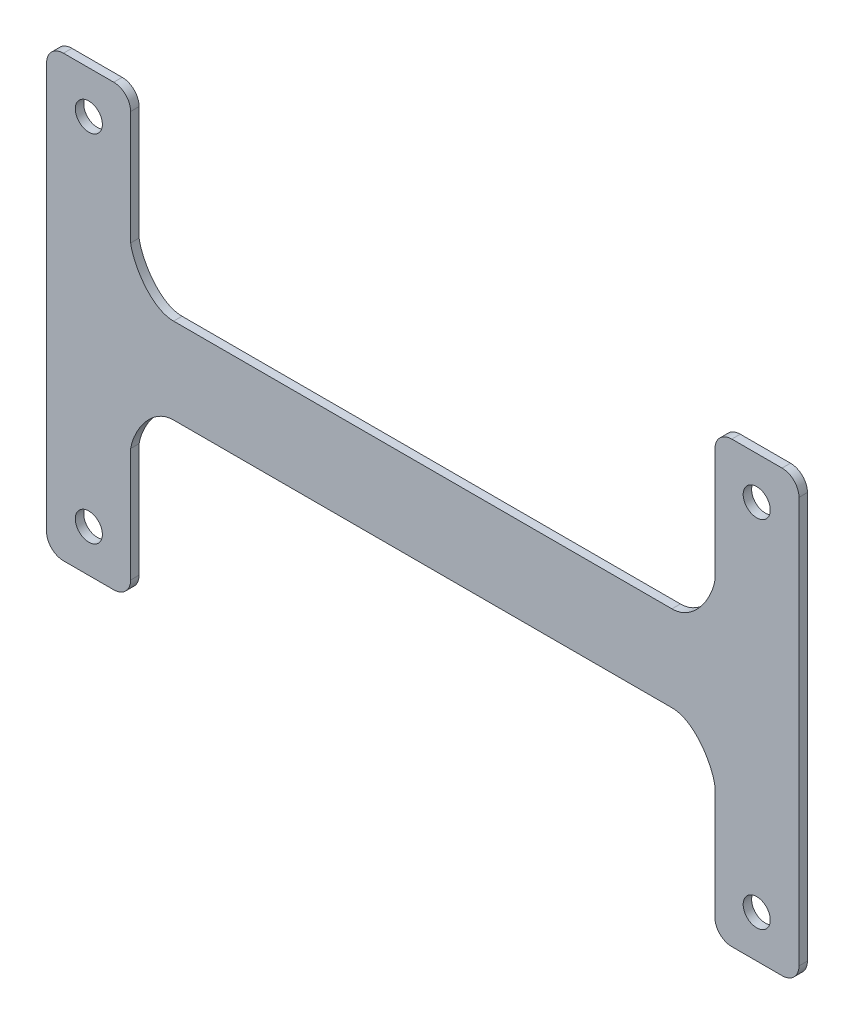
ISO-10303-21;
HEADER;
FILE_DESCRIPTION(('STEP AP214'),'2;1');
FILE_NAME('part.step','',(''),(''),'','','');
FILE_SCHEMA(('AUTOMOTIVE_DESIGN { 1 0 10303 214 1 1 1 1 }'));
ENDSEC;
DATA;
#1=APPLICATION_CONTEXT('core data for automotive mechanical design processes');
#2=APPLICATION_PROTOCOL_DEFINITION('international standard','automotive_design',2000,#1);
#3=PRODUCT_CONTEXT('',#1,'mechanical');
#4=PRODUCT('Part','Part','',(#3));
#5=PRODUCT_RELATED_PRODUCT_CATEGORY('part','',(#4));
#6=PRODUCT_DEFINITION_FORMATION('','',#4);
#7=PRODUCT_DEFINITION_CONTEXT('part definition',#1,'design');
#8=PRODUCT_DEFINITION('design','',#6,#7);
#9=PRODUCT_DEFINITION_SHAPE('','',#8);
#10=(LENGTH_UNIT() NAMED_UNIT(*) SI_UNIT(.MILLI.,.METRE.));
#11=(NAMED_UNIT(*) PLANE_ANGLE_UNIT() SI_UNIT($,.RADIAN.));
#12=(NAMED_UNIT(*) SI_UNIT($,.STERADIAN.) SOLID_ANGLE_UNIT());
#13=UNCERTAINTY_MEASURE_WITH_UNIT(LENGTH_MEASURE(1.E-05),#10,'distance_accuracy_value','');
#14=(GEOMETRIC_REPRESENTATION_CONTEXT(3) GLOBAL_UNCERTAINTY_ASSIGNED_CONTEXT((#13)) GLOBAL_UNIT_ASSIGNED_CONTEXT((#10,
#11,#12)) REPRESENTATION_CONTEXT('',''));
#15=CARTESIAN_POINT('',(0.,0.,0.));
#16=DIRECTION('',(0.,0.,1.));
#17=DIRECTION('',(1.,0.,0.));
#18=AXIS2_PLACEMENT_3D('',#15,#16,#17);
#19=CARTESIAN_POINT('',(44.5,-26.,-1.));
#20=DIRECTION('',(0.,-1.,0.));
#21=DIRECTION('',(1.,0.,0.));
#22=AXIS2_PLACEMENT_3D('',#19,#20,#21);
#23=PLANE('',#22);
#24=DIRECTION('',(1.,0.,0.));
#25=VECTOR('',#24,1.);
#26=CARTESIAN_POINT('',(44.5,-26.,-1.));
#27=LINE('',#26,#25);
#28=CARTESIAN_POINT('',(36.5550898515335,-26.,-1.));
#29=VERTEX_POINT('',#28);
#30=CARTESIAN_POINT('',(42.5,-26.,-1.));
#31=VERTEX_POINT('',#30);
#32=EDGE_CURVE('E368',#29,#31,#27,.T.);
#33=ORIENTED_EDGE('',*,*,#32,.T.);
#34=DIRECTION('',(0.,0.,1.));
#35=VECTOR('',#34,1.);
#36=CARTESIAN_POINT('',(42.5,-26.,-1.));
#37=LINE('',#36,#35);
#38=CARTESIAN_POINT('',(42.5,-26.,0.));
#39=VERTEX_POINT('',#38);
#40=EDGE_CURVE('E302',#31,#39,#37,.T.);
#41=ORIENTED_EDGE('',*,*,#40,.T.);
#42=DIRECTION('',(1.,0.,0.));
#43=VECTOR('',#42,1.);
#44=CARTESIAN_POINT('',(44.5,-26.,0.));
#45=LINE('',#44,#43);
#46=CARTESIAN_POINT('',(36.5550898515335,-26.,0.));
#47=VERTEX_POINT('',#46);
#48=EDGE_CURVE('E424',#47,#39,#45,.T.);
#49=ORIENTED_EDGE('',*,*,#48,.F.);
#50=DIRECTION('',(0.,0.,1.));
#51=VECTOR('',#50,1.);
#52=CARTESIAN_POINT('',(36.5550898515335,-26.,-1.));
#53=LINE('',#52,#51);
#54=EDGE_CURVE('E307',#47,#29,#53,.F.);
#55=ORIENTED_EDGE('',*,*,#54,.T.);
#56=EDGE_LOOP('',(#33,#41,#49,#55));
#57=FACE_BOUND('',#56,.T.);
#58=ADVANCED_FACE('F33',(#57),#23,.T.);
#59=CARTESIAN_POINT('',(34.5550898515335,-10.5296083014168,-1.));
#60=DIRECTION('',(-1.,0.,0.));
#61=DIRECTION('',(0.,-1.,0.));
#62=AXIS2_PLACEMENT_3D('',#59,#60,#61);
#63=PLANE('',#62);
#64=DIRECTION('',(0.,-1.,0.));
#65=VECTOR('',#64,1.);
#66=CARTESIAN_POINT('',(34.5550898515335,-10.5296083014168,-1.));
#67=LINE('',#66,#65);
#68=CARTESIAN_POINT('',(34.5550898515335,-10.5296083014168,-1.));
#69=VERTEX_POINT('',#68);
#70=CARTESIAN_POINT('',(34.5550898515335,-24.,-1.));
#71=VERTEX_POINT('',#70);
#72=EDGE_CURVE('E213',#69,#71,#67,.T.);
#73=ORIENTED_EDGE('',*,*,#72,.T.);
#74=DIRECTION('',(0.,0.,1.));
#75=VECTOR('',#74,1.);
#76=CARTESIAN_POINT('',(34.5550898515335,-24.,-1.));
#77=LINE('',#76,#75);
#78=CARTESIAN_POINT('',(34.5550898515335,-24.,0.));
#79=VERTEX_POINT('',#78);
#80=EDGE_CURVE('E311',#71,#79,#77,.T.);
#81=ORIENTED_EDGE('',*,*,#80,.T.);
#82=DIRECTION('',(0.,-1.,0.));
#83=VECTOR('',#82,1.);
#84=CARTESIAN_POINT('',(34.5550898515335,-10.5296083014168,0.));
#85=LINE('',#84,#83);
#86=CARTESIAN_POINT('',(34.5550898515335,-10.5296083014168,0.));
#87=VERTEX_POINT('',#86);
#88=EDGE_CURVE('E365',#87,#79,#85,.T.);
#89=ORIENTED_EDGE('',*,*,#88,.F.);
#90=DIRECTION('',(0.,0.,1.));
#91=VECTOR('',#90,1.);
#92=CARTESIAN_POINT('',(34.5550898515335,-10.5296083014168,-1.));
#93=LINE('',#92,#91);
#94=EDGE_CURVE('E350',#69,#87,#93,.T.);
#95=ORIENTED_EDGE('',*,*,#94,.F.);
#96=EDGE_LOOP('',(#73,#81,#89,#95));
#97=FACE_BOUND('',#96,.T.);
#98=ADVANCED_FACE('F248',(#97),#63,.T.);
#99=CARTESIAN_POINT('',(29.4715570654732,-5.06722644424445,-1.));
#100=CARTESIAN_POINT('',(32.0820612443157,-5.04423915029166,-1.));
#101=CARTESIAN_POINT('',(34.2156660526155,-8.39349498213915,-1.));
#102=CARTESIAN_POINT('',(34.5550898515335,-10.5296083014168,-1.));
#103=B_SPLINE_CURVE_WITH_KNOTS('',3,(#99,#100,#101,#102),.UNSPECIFIED.,.F.,.F.,(4,4),(0.,1.),.UNSPECIFIED.);
#104=DIRECTION('',(0.,0.,1.));
#105=VECTOR('',#104,1.);
#106=SURFACE_OF_LINEAR_EXTRUSION('',#103,#105);
#107=CARTESIAN_POINT('',(29.4715570654732,-5.06722644424445,0.));
#108=CARTESIAN_POINT('',(32.0820612443157,-5.04423915029166,0.));
#109=CARTESIAN_POINT('',(34.2156660526155,-8.39349498213915,0.));
#110=CARTESIAN_POINT('',(34.5550898515335,-10.5296083014168,0.));
#111=B_SPLINE_CURVE_WITH_KNOTS('',3,(#107,#108,#109,#110),.UNSPECIFIED.,.F.,.F.,(4,4),(0.,1.),.UNSPECIFIED.);
#112=CARTESIAN_POINT('',(29.4715570654732,-5.06722644424445,0.));
#113=VERTEX_POINT('',#112);
#114=EDGE_CURVE('E369',#113,#87,#111,.T.);
#115=ORIENTED_EDGE('',*,*,#114,.F.);
#116=DIRECTION('',(0.,0.,1.));
#117=VECTOR('',#116,1.);
#118=CARTESIAN_POINT('',(29.4715570654732,-5.06722644424445,-1.));
#119=LINE('',#118,#117);
#120=CARTESIAN_POINT('',(29.4715570654732,-5.06722644424445,-1.));
#121=VERTEX_POINT('',#120);
#122=EDGE_CURVE('E362',#121,#113,#119,.T.);
#123=ORIENTED_EDGE('',*,*,#122,.F.);
#124=EDGE_CURVE('E430',#121,#69,#103,.T.);
#125=ORIENTED_EDGE('',*,*,#124,.T.);
#126=ORIENTED_EDGE('',*,*,#94,.T.);
#127=EDGE_LOOP('',(#115,#123,#125,#126));
#128=FACE_BOUND('',#127,.T.);
#129=ADVANCED_FACE('F442',(#128),#106,.T.);
#130=CARTESIAN_POINT('',(-29.4715570654732,-5.06722644424442,-1.));
#131=DIRECTION('',(0.,-1.,0.));
#132=DIRECTION('',(1.,0.,0.));
#133=AXIS2_PLACEMENT_3D('',#130,#131,#132);
#134=PLANE('',#133);
#135=DIRECTION('',(1.,0.,0.));
#136=VECTOR('',#135,1.);
#137=CARTESIAN_POINT('',(-29.4715570654732,-5.06722644424442,0.));
#138=LINE('',#137,#136);
#139=CARTESIAN_POINT('',(-29.4715570654732,-5.06722644424442,0.));
#140=VERTEX_POINT('',#139);
#141=EDGE_CURVE('E374',#140,#113,#138,.T.);
#142=ORIENTED_EDGE('',*,*,#141,.F.);
#143=DIRECTION('',(0.,0.,1.));
#144=VECTOR('',#143,1.);
#145=CARTESIAN_POINT('',(-29.4715570654732,-5.06722644424442,-1.));
#146=LINE('',#145,#144);
#147=CARTESIAN_POINT('',(-29.4715570654732,-5.06722644424442,-1.));
#148=VERTEX_POINT('',#147);
#149=EDGE_CURVE('E360',#148,#140,#146,.T.);
#150=ORIENTED_EDGE('',*,*,#149,.F.);
#151=DIRECTION('',(1.,0.,0.));
#152=VECTOR('',#151,1.);
#153=CARTESIAN_POINT('',(-29.4715570654732,-5.06722644424442,-1.));
#154=LINE('',#153,#152);
#155=EDGE_CURVE('E436',#148,#121,#154,.T.);
#156=ORIENTED_EDGE('',*,*,#155,.T.);
#157=ORIENTED_EDGE('',*,*,#122,.T.);
#158=EDGE_LOOP('',(#142,#150,#156,#157));
#159=FACE_BOUND('',#158,.T.);
#160=ADVANCED_FACE('F446',(#159),#134,.T.);
#161=CARTESIAN_POINT('',(-34.5550898515335,-10.5296083014167,-1.));
#162=CARTESIAN_POINT('',(-34.2156660526155,-8.3934949821391,-1.));
#163=CARTESIAN_POINT('',(-32.0820612443157,-5.04423915029165,-1.));
#164=CARTESIAN_POINT('',(-29.4715570654732,-5.06722644424442,-1.));
#165=B_SPLINE_CURVE_WITH_KNOTS('',3,(#161,#162,#163,#164),.UNSPECIFIED.,.F.,.F.,(4,4),(0.,1.),.UNSPECIFIED.);
#166=DIRECTION('',(0.,0.,1.));
#167=VECTOR('',#166,1.);
#168=SURFACE_OF_LINEAR_EXTRUSION('',#165,#167);
#169=CARTESIAN_POINT('',(-34.5550898515335,-10.5296083014167,0.));
#170=CARTESIAN_POINT('',(-34.2156660526155,-8.3934949821391,0.));
#171=CARTESIAN_POINT('',(-32.0820612443157,-5.04423915029165,0.));
#172=CARTESIAN_POINT('',(-29.4715570654732,-5.06722644424442,0.));
#173=B_SPLINE_CURVE_WITH_KNOTS('',3,(#169,#170,#171,#172),.UNSPECIFIED.,.F.,.F.,(4,4),(0.,1.),.UNSPECIFIED.);
#174=CARTESIAN_POINT('',(-34.5550898515335,-10.5296083014167,0.));
#175=VERTEX_POINT('',#174);
#176=EDGE_CURVE('E380',#175,#140,#173,.T.);
#177=ORIENTED_EDGE('',*,*,#176,.F.);
#178=DIRECTION('',(0.,0.,1.));
#179=VECTOR('',#178,1.);
#180=CARTESIAN_POINT('',(-34.5550898515335,-10.5296083014167,-1.));
#181=LINE('',#180,#179);
#182=CARTESIAN_POINT('',(-34.5550898515335,-10.5296083014167,-1.));
#183=VERTEX_POINT('',#182);
#184=EDGE_CURVE('E357',#183,#175,#181,.T.);
#185=ORIENTED_EDGE('',*,*,#184,.F.);
#186=EDGE_CURVE('E458',#183,#148,#165,.T.);
#187=ORIENTED_EDGE('',*,*,#186,.T.);
#188=ORIENTED_EDGE('',*,*,#149,.T.);
#189=EDGE_LOOP('',(#177,#185,#187,#188));
#190=FACE_BOUND('',#189,.T.);
#191=ADVANCED_FACE('F451',(#190),#168,.T.);
#192=CARTESIAN_POINT('',(-34.5550898515335,-10.5296083014167,-1.));
#193=DIRECTION('',(1.,0.,0.));
#194=DIRECTION('',(0.,0.,-1.));
#195=AXIS2_PLACEMENT_3D('',#192,#193,#194);
#196=PLANE('',#195);
#197=DIRECTION('',(0.,1.,0.));
#198=VECTOR('',#197,1.);
#199=CARTESIAN_POINT('',(-34.5550898515335,-10.5296083014167,0.));
#200=LINE('',#199,#198);
#201=CARTESIAN_POINT('',(-34.5550898515335,-24.,0.));
#202=VERTEX_POINT('',#201);
#203=EDGE_CURVE('E385',#202,#175,#200,.T.);
#204=ORIENTED_EDGE('',*,*,#203,.F.);
#205=DIRECTION('',(0.,0.,1.));
#206=VECTOR('',#205,1.);
#207=CARTESIAN_POINT('',(-34.5550898515335,-24.,-1.));
#208=LINE('',#207,#206);
#209=CARTESIAN_POINT('',(-34.5550898515335,-24.,-1.));
#210=VERTEX_POINT('',#209);
#211=EDGE_CURVE('E316',#202,#210,#208,.F.);
#212=ORIENTED_EDGE('',*,*,#211,.T.);
#213=DIRECTION('',(0.,1.,0.));
#214=VECTOR('',#213,1.);
#215=CARTESIAN_POINT('',(-34.5550898515335,-10.5296083014167,-1.));
#216=LINE('',#215,#214);
#217=EDGE_CURVE('E464',#210,#183,#216,.T.);
#218=ORIENTED_EDGE('',*,*,#217,.T.);
#219=ORIENTED_EDGE('',*,*,#184,.T.);
#220=EDGE_LOOP('',(#204,#212,#218,#219));
#221=FACE_BOUND('',#220,.T.);
#222=ADVANCED_FACE('F455',(#221),#196,.T.);
#223=CARTESIAN_POINT('',(-44.5,-26.,-1.));
#224=DIRECTION('',(0.,-1.,0.));
#225=DIRECTION('',(1.,0.,0.));
#226=AXIS2_PLACEMENT_3D('',#223,#224,#225);
#227=PLANE('',#226);
#228=DIRECTION('',(1.,0.,0.));
#229=VECTOR('',#228,1.);
#230=CARTESIAN_POINT('',(-44.5,-26.,-1.));
#231=LINE('',#230,#229);
#232=CARTESIAN_POINT('',(-42.5,-26.,-1.));
#233=VERTEX_POINT('',#232);
#234=CARTESIAN_POINT('',(-36.5550898515335,-26.,-1.));
#235=VERTEX_POINT('',#234);
#236=EDGE_CURVE('E469',#233,#235,#231,.T.);
#237=ORIENTED_EDGE('',*,*,#236,.T.);
#238=DIRECTION('',(0.,0.,1.));
#239=VECTOR('',#238,1.);
#240=CARTESIAN_POINT('',(-36.5550898515335,-26.,-1.));
#241=LINE('',#240,#239);
#242=CARTESIAN_POINT('',(-36.5550898515335,-26.,0.));
#243=VERTEX_POINT('',#242);
#244=EDGE_CURVE('E320',#235,#243,#241,.T.);
#245=ORIENTED_EDGE('',*,*,#244,.T.);
#246=DIRECTION('',(1.,0.,0.));
#247=VECTOR('',#246,1.);
#248=CARTESIAN_POINT('',(-44.5,-26.,0.));
#249=LINE('',#248,#247);
#250=CARTESIAN_POINT('',(-42.5,-26.,0.));
#251=VERTEX_POINT('',#250);
#252=EDGE_CURVE('E390',#251,#243,#249,.T.);
#253=ORIENTED_EDGE('',*,*,#252,.F.);
#254=DIRECTION('',(0.,0.,1.));
#255=VECTOR('',#254,1.);
#256=CARTESIAN_POINT('',(-42.5,-26.,-1.));
#257=LINE('',#256,#255);
#258=EDGE_CURVE('E325',#251,#233,#257,.F.);
#259=ORIENTED_EDGE('',*,*,#258,.T.);
#260=EDGE_LOOP('',(#237,#245,#253,#259));
#261=FACE_BOUND('',#260,.T.);
#262=ADVANCED_FACE('F500',(#261),#227,.T.);
#263=CARTESIAN_POINT('',(-44.5,26.,-1.));
#264=DIRECTION('',(-1.,0.,0.));
#265=DIRECTION('',(0.,0.,1.));
#266=AXIS2_PLACEMENT_3D('',#263,#264,#265);
#267=PLANE('',#266);
#268=DIRECTION('',(0.,-1.,0.));
#269=VECTOR('',#268,1.);
#270=CARTESIAN_POINT('',(-44.5,26.,-1.));
#271=LINE('',#270,#269);
#272=CARTESIAN_POINT('',(-44.5,24.,-1.));
#273=VERTEX_POINT('',#272);
#274=CARTESIAN_POINT('',(-44.5,-24.,-1.));
#275=VERTEX_POINT('',#274);
#276=EDGE_CURVE('E472',#273,#275,#271,.T.);
#277=ORIENTED_EDGE('',*,*,#276,.T.);
#278=DIRECTION('',(0.,0.,1.));
#279=VECTOR('',#278,1.);
#280=CARTESIAN_POINT('',(-44.5,-24.,-1.));
#281=LINE('',#280,#279);
#282=CARTESIAN_POINT('',(-44.5,-24.,0.));
#283=VERTEX_POINT('',#282);
#284=EDGE_CURVE('E329',#275,#283,#281,.T.);
#285=ORIENTED_EDGE('',*,*,#284,.T.);
#286=DIRECTION('',(0.,-1.,0.));
#287=VECTOR('',#286,1.);
#288=CARTESIAN_POINT('',(-44.5,26.,0.));
#289=LINE('',#288,#287);
#290=CARTESIAN_POINT('',(-44.5,24.,0.));
#291=VERTEX_POINT('',#290);
#292=EDGE_CURVE('E393',#291,#283,#289,.T.);
#293=ORIENTED_EDGE('',*,*,#292,.F.);
#294=DIRECTION('',(0.,0.,1.));
#295=VECTOR('',#294,1.);
#296=CARTESIAN_POINT('',(-44.5,24.,-1.));
#297=LINE('',#296,#295);
#298=EDGE_CURVE('E344',#291,#273,#297,.F.);
#299=ORIENTED_EDGE('',*,*,#298,.T.);
#300=EDGE_LOOP('',(#277,#285,#293,#299));
#301=FACE_BOUND('',#300,.T.);
#302=ADVANCED_FACE('F497',(#301),#267,.T.);
#303=CARTESIAN_POINT('',(-44.5,26.,-1.));
#304=DIRECTION('',(0.,1.,0.));
#305=DIRECTION('',(0.,0.,1.));
#306=AXIS2_PLACEMENT_3D('',#303,#304,#305);
#307=PLANE('',#306);
#308=DIRECTION('',(-1.,0.,0.));
#309=VECTOR('',#308,1.);
#310=CARTESIAN_POINT('',(-44.5,26.,0.));
#311=LINE('',#310,#309);
#312=CARTESIAN_POINT('',(-36.5550898515335,26.,0.));
#313=VERTEX_POINT('',#312);
#314=CARTESIAN_POINT('',(-42.5,26.,0.));
#315=VERTEX_POINT('',#314);
#316=EDGE_CURVE('E396',#313,#315,#311,.T.);
#317=ORIENTED_EDGE('',*,*,#316,.F.);
#318=DIRECTION('',(0.,0.,1.));
#319=VECTOR('',#318,1.);
#320=CARTESIAN_POINT('',(-36.5550898515335,26.,-1.));
#321=LINE('',#320,#319);
#322=CARTESIAN_POINT('',(-36.5550898515335,26.,-1.));
#323=VERTEX_POINT('',#322);
#324=EDGE_CURVE('E334',#313,#323,#321,.F.);
#325=ORIENTED_EDGE('',*,*,#324,.T.);
#326=DIRECTION('',(-1.,0.,0.));
#327=VECTOR('',#326,1.);
#328=CARTESIAN_POINT('',(-44.5,26.,-1.));
#329=LINE('',#328,#327);
#330=CARTESIAN_POINT('',(-42.5,26.,-1.));
#331=VERTEX_POINT('',#330);
#332=EDGE_CURVE('E475',#323,#331,#329,.T.);
#333=ORIENTED_EDGE('',*,*,#332,.T.);
#334=DIRECTION('',(0.,0.,1.));
#335=VECTOR('',#334,1.);
#336=CARTESIAN_POINT('',(-42.5,26.,-1.));
#337=LINE('',#336,#335);
#338=EDGE_CURVE('E348',#331,#315,#337,.T.);
#339=ORIENTED_EDGE('',*,*,#338,.T.);
#340=EDGE_LOOP('',(#317,#325,#333,#339));
#341=FACE_BOUND('',#340,.T.);
#342=ADVANCED_FACE('F493',(#341),#307,.T.);
#343=CARTESIAN_POINT('',(-34.5550898515335,10.5296083014167,-1.));
#344=DIRECTION('',(1.,0.,0.));
#345=DIRECTION('',(0.,0.,-1.));
#346=AXIS2_PLACEMENT_3D('',#343,#344,#345);
#347=PLANE('',#346);
#348=DIRECTION('',(0.,1.,0.));
#349=VECTOR('',#348,1.);
#350=CARTESIAN_POINT('',(-34.5550898515335,10.5296083014167,-1.));
#351=LINE('',#350,#349);
#352=CARTESIAN_POINT('',(-34.5550898515335,10.5296083014167,-1.));
#353=VERTEX_POINT('',#352);
#354=CARTESIAN_POINT('',(-34.5550898515335,24.,-1.));
#355=VERTEX_POINT('',#354);
#356=EDGE_CURVE('E477',#353,#355,#351,.T.);
#357=ORIENTED_EDGE('',*,*,#356,.T.);
#358=DIRECTION('',(0.,0.,1.));
#359=VECTOR('',#358,1.);
#360=CARTESIAN_POINT('',(-34.5550898515335,24.,-1.));
#361=LINE('',#360,#359);
#362=CARTESIAN_POINT('',(-34.5550898515335,24.,0.));
#363=VERTEX_POINT('',#362);
#364=EDGE_CURVE('E338',#355,#363,#361,.T.);
#365=ORIENTED_EDGE('',*,*,#364,.T.);
#366=DIRECTION('',(0.,1.,0.));
#367=VECTOR('',#366,1.);
#368=CARTESIAN_POINT('',(-34.5550898515335,10.5296083014167,0.));
#369=LINE('',#368,#367);
#370=CARTESIAN_POINT('',(-34.5550898515335,10.5296083014167,0.));
#371=VERTEX_POINT('',#370);
#372=EDGE_CURVE('E398',#371,#363,#369,.T.);
#373=ORIENTED_EDGE('',*,*,#372,.F.);
#374=DIRECTION('',(0.,0.,1.));
#375=VECTOR('',#374,1.);
#376=CARTESIAN_POINT('',(-34.5550898515335,10.5296083014167,-1.));
#377=LINE('',#376,#375);
#378=EDGE_CURVE('E355',#353,#371,#377,.T.);
#379=ORIENTED_EDGE('',*,*,#378,.F.);
#380=EDGE_LOOP('',(#357,#365,#373,#379));
#381=FACE_BOUND('',#380,.T.);
#382=ADVANCED_FACE('F489',(#381),#347,.T.);
#383=CARTESIAN_POINT('',(-29.4715570654732,5.06722644424442,-1.));
#384=CARTESIAN_POINT('',(-32.0820612443158,5.04423915029165,-1.));
#385=CARTESIAN_POINT('',(-34.2156660526154,8.39349498213911,-1.));
#386=CARTESIAN_POINT('',(-34.5550898515335,10.5296083014167,-1.));
#387=B_SPLINE_CURVE_WITH_KNOTS('',3,(#383,#384,#385,#386),.UNSPECIFIED.,.F.,.F.,(4,4),(0.,1.),.UNSPECIFIED.);
#388=DIRECTION('',(0.,0.,1.));
#389=VECTOR('',#388,1.);
#390=SURFACE_OF_LINEAR_EXTRUSION('',#387,#389);
#391=CARTESIAN_POINT('',(-29.4715570654732,5.06722644424442,0.));
#392=CARTESIAN_POINT('',(-32.0820612443158,5.04423915029165,0.));
#393=CARTESIAN_POINT('',(-34.2156660526154,8.39349498213911,0.));
#394=CARTESIAN_POINT('',(-34.5550898515335,10.5296083014167,0.));
#395=B_SPLINE_CURVE_WITH_KNOTS('',3,(#391,#392,#393,#394),.UNSPECIFIED.,.F.,.F.,(4,4),(0.,1.),.UNSPECIFIED.);
#396=CARTESIAN_POINT('',(-29.4715570654732,5.06722644424442,0.));
#397=VERTEX_POINT('',#396);
#398=EDGE_CURVE('E401',#397,#371,#395,.T.);
#399=ORIENTED_EDGE('',*,*,#398,.F.);
#400=DIRECTION('',(0.,0.,1.));
#401=VECTOR('',#400,1.);
#402=CARTESIAN_POINT('',(-29.4715570654732,5.06722644424442,-1.));
#403=LINE('',#402,#401);
#404=CARTESIAN_POINT('',(-29.4715570654732,5.06722644424442,-1.));
#405=VERTEX_POINT('',#404);
#406=EDGE_CURVE('E353',#405,#397,#403,.T.);
#407=ORIENTED_EDGE('',*,*,#406,.F.);
#408=EDGE_CURVE('E221',#405,#353,#387,.T.);
#409=ORIENTED_EDGE('',*,*,#408,.T.);
#410=ORIENTED_EDGE('',*,*,#378,.T.);
#411=EDGE_LOOP('',(#399,#407,#409,#410));
#412=FACE_BOUND('',#411,.T.);
#413=ADVANCED_FACE('F486',(#412),#390,.T.);
#414=CARTESIAN_POINT('',(-29.4715570654732,5.06722644424442,-1.));
#415=DIRECTION('',(0.,1.,0.));
#416=DIRECTION('',(-1.,0.,0.));
#417=AXIS2_PLACEMENT_3D('',#414,#415,#416);
#418=PLANE('',#417);
#419=DIRECTION('',(-1.,0.,0.));
#420=VECTOR('',#419,1.);
#421=CARTESIAN_POINT('',(-29.4715570654732,5.06722644424442,0.));
#422=LINE('',#421,#420);
#423=CARTESIAN_POINT('',(29.4715570654732,5.06722644424442,0.));
#424=VERTEX_POINT('',#423);
#425=EDGE_CURVE('E406',#424,#397,#422,.T.);
#426=ORIENTED_EDGE('',*,*,#425,.F.);
#427=DIRECTION('',(0.,0.,1.));
#428=VECTOR('',#427,1.);
#429=CARTESIAN_POINT('',(29.4715570654732,5.06722644424442,-1.));
#430=LINE('',#429,#428);
#431=CARTESIAN_POINT('',(29.4715570654732,5.06722644424442,-1.));
#432=VERTEX_POINT('',#431);
#433=EDGE_CURVE('E212',#432,#424,#430,.T.);
#434=ORIENTED_EDGE('',*,*,#433,.F.);
#435=DIRECTION('',(-1.,0.,0.));
#436=VECTOR('',#435,1.);
#437=CARTESIAN_POINT('',(-29.4715570654732,5.06722644424442,-1.));
#438=LINE('',#437,#436);
#439=EDGE_CURVE('E219',#432,#405,#438,.T.);
#440=ORIENTED_EDGE('',*,*,#439,.T.);
#441=ORIENTED_EDGE('',*,*,#406,.T.);
#442=EDGE_LOOP('',(#426,#434,#440,#441));
#443=FACE_BOUND('',#442,.T.);
#444=ADVANCED_FACE('F235',(#443),#418,.T.);
#445=CARTESIAN_POINT('',(34.5550898515335,10.5296083014168,-1.));
#446=CARTESIAN_POINT('',(34.2156660526155,8.39349498213824,-1.));
#447=CARTESIAN_POINT('',(32.0820612443157,5.04423915029266,-1.));
#448=CARTESIAN_POINT('',(29.4715570654732,5.06722644424442,-1.));
#449=B_SPLINE_CURVE_WITH_KNOTS('',3,(#445,#446,#447,#448),.UNSPECIFIED.,.F.,.F.,(4,4),(0.,1.),.UNSPECIFIED.);
#450=DIRECTION('',(0.,0.,1.));
#451=VECTOR('',#450,1.);
#452=SURFACE_OF_LINEAR_EXTRUSION('',#449,#451);
#453=CARTESIAN_POINT('',(34.5550898515335,10.5296083014168,0.));
#454=CARTESIAN_POINT('',(34.2156660526155,8.39349498213824,0.));
#455=CARTESIAN_POINT('',(32.0820612443157,5.04423915029266,0.));
#456=CARTESIAN_POINT('',(29.4715570654732,5.06722644424442,0.));
#457=B_SPLINE_CURVE_WITH_KNOTS('',3,(#453,#454,#455,#456),.UNSPECIFIED.,.F.,.F.,(4,4),(0.,1.),.UNSPECIFIED.);
#458=CARTESIAN_POINT('',(34.5550898515335,10.5296083014168,0.));
#459=VERTEX_POINT('',#458);
#460=EDGE_CURVE('E211',#459,#424,#457,.T.);
#461=ORIENTED_EDGE('',*,*,#460,.F.);
#462=DIRECTION('',(0.,0.,1.));
#463=VECTOR('',#462,1.);
#464=CARTESIAN_POINT('',(34.5550898515335,10.5296083014168,-1.));
#465=LINE('',#464,#463);
#466=CARTESIAN_POINT('',(34.5550898515335,10.5296083014168,-1.));
#467=VERTEX_POINT('',#466);
#468=EDGE_CURVE('E196',#467,#459,#465,.T.);
#469=ORIENTED_EDGE('',*,*,#468,.F.);
#470=EDGE_CURVE('E204',#467,#432,#449,.T.);
#471=ORIENTED_EDGE('',*,*,#470,.T.);
#472=ORIENTED_EDGE('',*,*,#433,.T.);
#473=EDGE_LOOP('',(#461,#469,#471,#472));
#474=FACE_BOUND('',#473,.T.);
#475=ADVANCED_FACE('F209',(#474),#452,.T.);
#476=CARTESIAN_POINT('',(34.5550898515335,10.5296083014168,-1.));
#477=DIRECTION('',(-1.,0.,0.));
#478=DIRECTION('',(0.,-1.,0.));
#479=AXIS2_PLACEMENT_3D('',#476,#477,#478);
#480=PLANE('',#479);
#481=DIRECTION('',(0.,-1.,0.));
#482=VECTOR('',#481,1.);
#483=CARTESIAN_POINT('',(34.5550898515335,10.5296083014168,0.));
#484=LINE('',#483,#482);
#485=CARTESIAN_POINT('',(34.5550898515335,24.,0.));
#486=VERTEX_POINT('',#485);
#487=EDGE_CURVE('E415',#486,#459,#484,.T.);
#488=ORIENTED_EDGE('',*,*,#487,.F.);
#489=DIRECTION('',(0.,0.,1.));
#490=VECTOR('',#489,1.);
#491=CARTESIAN_POINT('',(34.5550898515335,24.,-1.));
#492=LINE('',#491,#490);
#493=CARTESIAN_POINT('',(34.5550898515335,24.,-1.));
#494=VERTEX_POINT('',#493);
#495=EDGE_CURVE('E199',#486,#494,#492,.F.);
#496=ORIENTED_EDGE('',*,*,#495,.T.);
#497=DIRECTION('',(0.,-1.,0.));
#498=VECTOR('',#497,1.);
#499=CARTESIAN_POINT('',(34.5550898515335,10.5296083014168,-1.));
#500=LINE('',#499,#498);
#501=EDGE_CURVE('E192',#494,#467,#500,.T.);
#502=ORIENTED_EDGE('',*,*,#501,.T.);
#503=ORIENTED_EDGE('',*,*,#468,.T.);
#504=EDGE_LOOP('',(#488,#496,#502,#503));
#505=FACE_BOUND('',#504,.T.);
#506=ADVANCED_FACE('F195',(#505),#480,.T.);
#507=CARTESIAN_POINT('',(44.5,26.,-1.));
#508=DIRECTION('',(0.,1.,0.));
#509=DIRECTION('',(-1.,0.,0.));
#510=AXIS2_PLACEMENT_3D('',#507,#508,#509);
#511=PLANE('',#510);
#512=DIRECTION('',(-1.,0.,0.));
#513=VECTOR('',#512,1.);
#514=CARTESIAN_POINT('',(44.5,26.,0.));
#515=LINE('',#514,#513);
#516=CARTESIAN_POINT('',(42.5,26.,0.));
#517=VERTEX_POINT('',#516);
#518=CARTESIAN_POINT('',(36.5550898515335,26.,0.));
#519=VERTEX_POINT('',#518);
#520=EDGE_CURVE('E420',#517,#519,#515,.T.);
#521=ORIENTED_EDGE('',*,*,#520,.F.);
#522=DIRECTION('',(0.,0.,1.));
#523=VECTOR('',#522,1.);
#524=CARTESIAN_POINT('',(42.5,26.,-1.));
#525=LINE('',#524,#523);
#526=CARTESIAN_POINT('',(42.5,26.,-1.));
#527=VERTEX_POINT('',#526);
#528=EDGE_CURVE('E41',#517,#527,#525,.F.);
#529=ORIENTED_EDGE('',*,*,#528,.T.);
#530=DIRECTION('',(-1.,0.,0.));
#531=VECTOR('',#530,1.);
#532=CARTESIAN_POINT('',(44.5,26.,-1.));
#533=LINE('',#532,#531);
#534=CARTESIAN_POINT('',(36.5550898515335,26.,-1.));
#535=VERTEX_POINT('',#534);
#536=EDGE_CURVE('E205',#527,#535,#533,.T.);
#537=ORIENTED_EDGE('',*,*,#536,.T.);
#538=DIRECTION('',(0.,0.,1.));
#539=VECTOR('',#538,1.);
#540=CARTESIAN_POINT('',(36.5550898515335,26.,-1.));
#541=LINE('',#540,#539);
#542=EDGE_CURVE('E285',#535,#519,#541,.T.);
#543=ORIENTED_EDGE('',*,*,#542,.T.);
#544=EDGE_LOOP('',(#521,#529,#537,#543));
#545=FACE_BOUND('',#544,.T.);
#546=ADVANCED_FACE('F239',(#545),#511,.T.);
#547=CARTESIAN_POINT('',(44.5,26.,-1.));
#548=DIRECTION('',(1.,0.,0.));
#549=DIRECTION('',(0.,0.,-1.));
#550=AXIS2_PLACEMENT_3D('',#547,#548,#549);
#551=PLANE('',#550);
#552=DIRECTION('',(0.,1.,0.));
#553=VECTOR('',#552,1.);
#554=CARTESIAN_POINT('',(44.5,26.,-1.));
#555=LINE('',#554,#553);
#556=CARTESIAN_POINT('',(44.5,-24.,-1.));
#557=VERTEX_POINT('',#556);
#558=CARTESIAN_POINT('',(44.5,24.,-1.));
#559=VERTEX_POINT('',#558);
#560=EDGE_CURVE('E538',#557,#559,#555,.T.);
#561=ORIENTED_EDGE('',*,*,#560,.T.);
#562=DIRECTION('',(0.,0.,1.));
#563=VECTOR('',#562,1.);
#564=CARTESIAN_POINT('',(44.5,24.,-1.));
#565=LINE('',#564,#563);
#566=CARTESIAN_POINT('',(44.5,24.,0.));
#567=VERTEX_POINT('',#566);
#568=EDGE_CURVE('E286',#559,#567,#565,.T.);
#569=ORIENTED_EDGE('',*,*,#568,.T.);
#570=DIRECTION('',(0.,1.,0.));
#571=VECTOR('',#570,1.);
#572=CARTESIAN_POINT('',(44.5,26.,0.));
#573=LINE('',#572,#571);
#574=CARTESIAN_POINT('',(44.5,-24.,0.));
#575=VERTEX_POINT('',#574);
#576=EDGE_CURVE('E422',#575,#567,#573,.T.);
#577=ORIENTED_EDGE('',*,*,#576,.F.);
#578=DIRECTION('',(0.,0.,1.));
#579=VECTOR('',#578,1.);
#580=CARTESIAN_POINT('',(44.5,-24.,-1.));
#581=LINE('',#580,#579);
#582=EDGE_CURVE('E298',#575,#557,#581,.F.);
#583=ORIENTED_EDGE('',*,*,#582,.T.);
#584=EDGE_LOOP('',(#561,#569,#577,#583));
#585=FACE_BOUND('',#584,.T.);
#586=ADVANCED_FACE('F242',(#585),#551,.T.);
#587=CARTESIAN_POINT('',(32.864978600975,-6.98875464286921,-1.));
#588=DIRECTION('',(0.,0.,-1.));
#589=DIRECTION('',(-1.,0.,0.));
#590=AXIS2_PLACEMENT_3D('',#587,#588,#589);
#591=PLANE('',#590);
#592=CARTESIAN_POINT('',(39.5,21.,-1.));
#593=DIRECTION('',(0.,0.,-1.));
#594=DIRECTION('',(-1.,0.,0.));
#595=AXIS2_PLACEMENT_3D('',#592,#593,#594);
#596=CIRCLE('',#595,1.6);
#597=CARTESIAN_POINT('',(37.9,21.,-1.));
#598=VERTEX_POINT('',#597);
#599=EDGE_CURVE('E766',#598,#598,#596,.T.);
#600=ORIENTED_EDGE('',*,*,#599,.F.);
#601=EDGE_LOOP('',(#600));
#602=FACE_BOUND('',#601,.T.);
#603=CARTESIAN_POINT('',(-39.5,-21.,-1.));
#604=DIRECTION('',(0.,0.,-1.));
#605=DIRECTION('',(-1.,0.,0.));
#606=AXIS2_PLACEMENT_3D('',#603,#604,#605);
#607=CIRCLE('',#606,1.6);
#608=CARTESIAN_POINT('',(-41.1,-21.,-1.));
#609=VERTEX_POINT('',#608);
#610=EDGE_CURVE('E774',#609,#609,#607,.T.);
#611=ORIENTED_EDGE('',*,*,#610,.F.);
#612=EDGE_LOOP('',(#611));
#613=FACE_BOUND('',#612,.T.);
#614=CARTESIAN_POINT('',(39.5,-21.,-1.));
#615=DIRECTION('',(0.,0.,-1.));
#616=DIRECTION('',(-1.,0.,0.));
#617=AXIS2_PLACEMENT_3D('',#614,#615,#616);
#618=CIRCLE('',#617,1.6);
#619=CARTESIAN_POINT('',(37.9,-21.,-1.));
#620=VERTEX_POINT('',#619);
#621=EDGE_CURVE('E770',#620,#620,#618,.T.);
#622=ORIENTED_EDGE('',*,*,#621,.F.);
#623=EDGE_LOOP('',(#622));
#624=FACE_BOUND('',#623,.T.);
#625=CARTESIAN_POINT('',(-39.5,21.,-1.));
#626=DIRECTION('',(0.,0.,-1.));
#627=DIRECTION('',(-1.,0.,0.));
#628=AXIS2_PLACEMENT_3D('',#625,#626,#627);
#629=CIRCLE('',#628,1.6);
#630=CARTESIAN_POINT('',(-41.1,21.,-1.));
#631=VERTEX_POINT('',#630);
#632=EDGE_CURVE('E427',#631,#631,#629,.T.);
#633=ORIENTED_EDGE('',*,*,#632,.F.);
#634=EDGE_LOOP('',(#633));
#635=FACE_BOUND('',#634,.T.);
#636=ORIENTED_EDGE('',*,*,#536,.F.);
#637=CARTESIAN_POINT('',(42.5,24.,-1.));
#638=DIRECTION('',(0.,0.,-1.));
#639=DIRECTION('',(-1.,0.,0.));
#640=AXIS2_PLACEMENT_3D('',#637,#638,#639);
#641=CIRCLE('',#640,2.);
#642=EDGE_CURVE('E11',#527,#559,#641,.T.);
#643=ORIENTED_EDGE('',*,*,#642,.T.);
#644=ORIENTED_EDGE('',*,*,#560,.F.);
#645=CARTESIAN_POINT('',(42.5,-24.,-1.));
#646=DIRECTION('',(0.,0.,-1.));
#647=DIRECTION('',(-1.,0.,0.));
#648=AXIS2_PLACEMENT_3D('',#645,#646,#647);
#649=CIRCLE('',#648,2.);
#650=EDGE_CURVE('E296',#557,#31,#649,.T.);
#651=ORIENTED_EDGE('',*,*,#650,.T.);
#652=ORIENTED_EDGE('',*,*,#32,.F.);
#653=CARTESIAN_POINT('',(36.5550898515335,-24.,-1.));
#654=DIRECTION('',(0.,0.,-1.));
#655=DIRECTION('',(-1.,0.,0.));
#656=AXIS2_PLACEMENT_3D('',#653,#654,#655);
#657=CIRCLE('',#656,2.);
#658=EDGE_CURVE('E305',#29,#71,#657,.T.);
#659=ORIENTED_EDGE('',*,*,#658,.T.);
#660=ORIENTED_EDGE('',*,*,#72,.F.);
#661=ORIENTED_EDGE('',*,*,#124,.F.);
#662=ORIENTED_EDGE('',*,*,#155,.F.);
#663=ORIENTED_EDGE('',*,*,#186,.F.);
#664=ORIENTED_EDGE('',*,*,#217,.F.);
#665=CARTESIAN_POINT('',(-36.5550898515335,-24.,-1.));
#666=DIRECTION('',(0.,0.,-1.));
#667=DIRECTION('',(-1.,0.,0.));
#668=AXIS2_PLACEMENT_3D('',#665,#666,#667);
#669=CIRCLE('',#668,2.);
#670=EDGE_CURVE('E314',#210,#235,#669,.T.);
#671=ORIENTED_EDGE('',*,*,#670,.T.);
#672=ORIENTED_EDGE('',*,*,#236,.F.);
#673=CARTESIAN_POINT('',(-42.5,-24.,-1.));
#674=DIRECTION('',(0.,0.,-1.));
#675=DIRECTION('',(-1.,0.,0.));
#676=AXIS2_PLACEMENT_3D('',#673,#674,#675);
#677=CIRCLE('',#676,2.);
#678=EDGE_CURVE('E323',#233,#275,#677,.T.);
#679=ORIENTED_EDGE('',*,*,#678,.T.);
#680=ORIENTED_EDGE('',*,*,#276,.F.);
#681=CARTESIAN_POINT('',(-42.5,24.,-1.));
#682=DIRECTION('',(0.,0.,-1.));
#683=DIRECTION('',(-1.,0.,0.));
#684=AXIS2_PLACEMENT_3D('',#681,#682,#683);
#685=CIRCLE('',#684,2.);
#686=EDGE_CURVE('E341',#273,#331,#685,.T.);
#687=ORIENTED_EDGE('',*,*,#686,.T.);
#688=ORIENTED_EDGE('',*,*,#332,.F.);
#689=CARTESIAN_POINT('',(-36.5550898515335,24.,-1.));
#690=DIRECTION('',(0.,0.,-1.));
#691=DIRECTION('',(-1.,0.,0.));
#692=AXIS2_PLACEMENT_3D('',#689,#690,#691);
#693=CIRCLE('',#692,2.);
#694=EDGE_CURVE('E332',#323,#355,#693,.T.);
#695=ORIENTED_EDGE('',*,*,#694,.T.);
#696=ORIENTED_EDGE('',*,*,#356,.F.);
#697=ORIENTED_EDGE('',*,*,#408,.F.);
#698=ORIENTED_EDGE('',*,*,#439,.F.);
#699=ORIENTED_EDGE('',*,*,#470,.F.);
#700=ORIENTED_EDGE('',*,*,#501,.F.);
#701=CARTESIAN_POINT('',(36.5550898515335,24.,-1.));
#702=DIRECTION('',(0.,0.,-1.));
#703=DIRECTION('',(-1.,0.,0.));
#704=AXIS2_PLACEMENT_3D('',#701,#702,#703);
#705=CIRCLE('',#704,2.);
#706=EDGE_CURVE('E282',#494,#535,#705,.T.);
#707=ORIENTED_EDGE('',*,*,#706,.T.);
#708=EDGE_LOOP('',(#636,#643,#644,#651,#652,#659,#660,#661,#662,#663,#664,#671,#672,#679,#680,
#687,#688,#695,#696,#697,#698,#699,#700,#707));
#709=FACE_BOUND('',#708,.T.);
#710=ADVANCED_FACE('F216',(#602,#613,#624,#635,#709),#591,.T.);
#711=CARTESIAN_POINT('',(32.864978600975,-6.98875464286921,0.));
#712=DIRECTION('',(0.,0.,-1.));
#713=DIRECTION('',(-1.,0.,0.));
#714=AXIS2_PLACEMENT_3D('',#711,#712,#713);
#715=PLANE('',#714);
#716=CARTESIAN_POINT('',(39.5,21.,0.));
#717=DIRECTION('',(0.,0.,1.));
#718=DIRECTION('',(1.,0.,0.));
#719=AXIS2_PLACEMENT_3D('',#716,#717,#718);
#720=CIRCLE('',#719,1.6);
#721=CARTESIAN_POINT('',(41.1,21.,0.));
#722=VERTEX_POINT('',#721);
#723=EDGE_CURVE('E769',#722,#722,#720,.T.);
#724=ORIENTED_EDGE('',*,*,#723,.F.);
#725=EDGE_LOOP('',(#724));
#726=FACE_BOUND('',#725,.T.);
#727=CARTESIAN_POINT('',(-39.5,-21.,0.));
#728=DIRECTION('',(0.,0.,1.));
#729=DIRECTION('',(1.,0.,0.));
#730=AXIS2_PLACEMENT_3D('',#727,#728,#729);
#731=CIRCLE('',#730,1.6);
#732=CARTESIAN_POINT('',(-37.9,-21.,0.));
#733=VERTEX_POINT('',#732);
#734=EDGE_CURVE('E771',#733,#733,#731,.T.);
#735=ORIENTED_EDGE('',*,*,#734,.F.);
#736=EDGE_LOOP('',(#735));
#737=FACE_BOUND('',#736,.T.);
#738=CARTESIAN_POINT('',(39.5,-21.,0.));
#739=DIRECTION('',(0.,0.,1.));
#740=DIRECTION('',(1.,0.,0.));
#741=AXIS2_PLACEMENT_3D('',#738,#739,#740);
#742=CIRCLE('',#741,1.6);
#743=CARTESIAN_POINT('',(41.1,-21.,0.));
#744=VERTEX_POINT('',#743);
#745=EDGE_CURVE('E777',#744,#744,#742,.T.);
#746=ORIENTED_EDGE('',*,*,#745,.F.);
#747=EDGE_LOOP('',(#746));
#748=FACE_BOUND('',#747,.T.);
#749=CARTESIAN_POINT('',(-39.5,21.,0.));
#750=DIRECTION('',(0.,0.,1.));
#751=DIRECTION('',(1.,0.,0.));
#752=AXIS2_PLACEMENT_3D('',#749,#750,#751);
#753=CIRCLE('',#752,1.6);
#754=CARTESIAN_POINT('',(-37.9,21.,0.));
#755=VERTEX_POINT('',#754);
#756=EDGE_CURVE('E784',#755,#755,#753,.T.);
#757=ORIENTED_EDGE('',*,*,#756,.F.);
#758=EDGE_LOOP('',(#757));
#759=FACE_BOUND('',#758,.T.);
#760=ORIENTED_EDGE('',*,*,#576,.T.);
#761=CARTESIAN_POINT('',(42.5,24.,0.));
#762=DIRECTION('',(0.,0.,-1.));
#763=DIRECTION('',(-1.,0.,0.));
#764=AXIS2_PLACEMENT_3D('',#761,#762,#763);
#765=CIRCLE('',#764,2.);
#766=EDGE_CURVE('E55',#567,#517,#765,.F.);
#767=ORIENTED_EDGE('',*,*,#766,.T.);
#768=ORIENTED_EDGE('',*,*,#520,.T.);
#769=CARTESIAN_POINT('',(36.5550898515335,24.,0.));
#770=DIRECTION('',(0.,0.,-1.));
#771=DIRECTION('',(-1.,0.,0.));
#772=AXIS2_PLACEMENT_3D('',#769,#770,#771);
#773=CIRCLE('',#772,2.);
#774=EDGE_CURVE('E290',#519,#486,#773,.F.);
#775=ORIENTED_EDGE('',*,*,#774,.T.);
#776=ORIENTED_EDGE('',*,*,#487,.T.);
#777=ORIENTED_EDGE('',*,*,#460,.T.);
#778=ORIENTED_EDGE('',*,*,#425,.T.);
#779=ORIENTED_EDGE('',*,*,#398,.T.);
#780=ORIENTED_EDGE('',*,*,#372,.T.);
#781=CARTESIAN_POINT('',(-36.5550898515335,24.,0.));
#782=DIRECTION('',(0.,0.,-1.));
#783=DIRECTION('',(-1.,0.,0.));
#784=AXIS2_PLACEMENT_3D('',#781,#782,#783);
#785=CIRCLE('',#784,2.);
#786=EDGE_CURVE('E336',#363,#313,#785,.F.);
#787=ORIENTED_EDGE('',*,*,#786,.T.);
#788=ORIENTED_EDGE('',*,*,#316,.T.);
#789=CARTESIAN_POINT('',(-42.5,24.,0.));
#790=DIRECTION('',(0.,0.,-1.));
#791=DIRECTION('',(-1.,0.,0.));
#792=AXIS2_PLACEMENT_3D('',#789,#790,#791);
#793=CIRCLE('',#792,2.);
#794=EDGE_CURVE('E346',#315,#291,#793,.F.);
#795=ORIENTED_EDGE('',*,*,#794,.T.);
#796=ORIENTED_EDGE('',*,*,#292,.T.);
#797=CARTESIAN_POINT('',(-42.5,-24.,0.));
#798=DIRECTION('',(0.,0.,-1.));
#799=DIRECTION('',(-1.,0.,0.));
#800=AXIS2_PLACEMENT_3D('',#797,#798,#799);
#801=CIRCLE('',#800,2.);
#802=EDGE_CURVE('E327',#283,#251,#801,.F.);
#803=ORIENTED_EDGE('',*,*,#802,.T.);
#804=ORIENTED_EDGE('',*,*,#252,.T.);
#805=CARTESIAN_POINT('',(-36.5550898515335,-24.,0.));
#806=DIRECTION('',(0.,0.,-1.));
#807=DIRECTION('',(-1.,0.,0.));
#808=AXIS2_PLACEMENT_3D('',#805,#806,#807);
#809=CIRCLE('',#808,2.);
#810=EDGE_CURVE('E318',#243,#202,#809,.F.);
#811=ORIENTED_EDGE('',*,*,#810,.T.);
#812=ORIENTED_EDGE('',*,*,#203,.T.);
#813=ORIENTED_EDGE('',*,*,#176,.T.);
#814=ORIENTED_EDGE('',*,*,#141,.T.);
#815=ORIENTED_EDGE('',*,*,#114,.T.);
#816=ORIENTED_EDGE('',*,*,#88,.T.);
#817=CARTESIAN_POINT('',(36.5550898515335,-24.,0.));
#818=DIRECTION('',(0.,0.,-1.));
#819=DIRECTION('',(-1.,0.,0.));
#820=AXIS2_PLACEMENT_3D('',#817,#818,#819);
#821=CIRCLE('',#820,2.);
#822=EDGE_CURVE('E309',#79,#47,#821,.F.);
#823=ORIENTED_EDGE('',*,*,#822,.T.);
#824=ORIENTED_EDGE('',*,*,#48,.T.);
#825=CARTESIAN_POINT('',(42.5,-24.,0.));
#826=DIRECTION('',(0.,0.,-1.));
#827=DIRECTION('',(-1.,0.,0.));
#828=AXIS2_PLACEMENT_3D('',#825,#826,#827);
#829=CIRCLE('',#828,2.);
#830=EDGE_CURVE('E300',#39,#575,#829,.F.);
#831=ORIENTED_EDGE('',*,*,#830,.T.);
#832=EDGE_LOOP('',(#760,#767,#768,#775,#776,#777,#778,#779,#780,#787,#788,#795,#796,#803,#804,
#811,#812,#813,#814,#815,#816,#823,#824,#831));
#833=FACE_BOUND('',#832,.T.);
#834=ADVANCED_FACE('F516',(#726,#737,#748,#759,#833),#715,.F.);
#835=CARTESIAN_POINT('',(-39.5,21.,-4.));
#836=DIRECTION('',(0.,0.,1.));
#837=DIRECTION('',(1.,0.,0.));
#838=AXIS2_PLACEMENT_3D('',#835,#836,#837);
#839=CYLINDRICAL_SURFACE('',#838,1.6);
#840=ORIENTED_EDGE('',*,*,#632,.T.);
#841=EDGE_LOOP('',(#840));
#842=FACE_BOUND('',#841,.T.);
#843=ORIENTED_EDGE('',*,*,#756,.T.);
#844=EDGE_LOOP('',(#843));
#845=FACE_BOUND('',#844,.T.);
#846=ADVANCED_FACE('F601',(#842,#845),#839,.F.);
#847=CARTESIAN_POINT('',(39.5,-21.,-4.));
#848=DIRECTION('',(0.,0.,1.));
#849=DIRECTION('',(1.,0.,0.));
#850=AXIS2_PLACEMENT_3D('',#847,#848,#849);
#851=CYLINDRICAL_SURFACE('',#850,1.6);
#852=ORIENTED_EDGE('',*,*,#621,.T.);
#853=EDGE_LOOP('',(#852));
#854=FACE_BOUND('',#853,.T.);
#855=ORIENTED_EDGE('',*,*,#745,.T.);
#856=EDGE_LOOP('',(#855));
#857=FACE_BOUND('',#856,.T.);
#858=ADVANCED_FACE('F608',(#854,#857),#851,.F.);
#859=CARTESIAN_POINT('',(-39.5,-21.,-4.));
#860=DIRECTION('',(0.,0.,1.));
#861=DIRECTION('',(1.,0.,0.));
#862=AXIS2_PLACEMENT_3D('',#859,#860,#861);
#863=CYLINDRICAL_SURFACE('',#862,1.6);
#864=ORIENTED_EDGE('',*,*,#610,.T.);
#865=EDGE_LOOP('',(#864));
#866=FACE_BOUND('',#865,.T.);
#867=ORIENTED_EDGE('',*,*,#734,.T.);
#868=EDGE_LOOP('',(#867));
#869=FACE_BOUND('',#868,.T.);
#870=ADVANCED_FACE('F616',(#866,#869),#863,.F.);
#871=CARTESIAN_POINT('',(39.5,21.,-4.));
#872=DIRECTION('',(0.,0.,1.));
#873=DIRECTION('',(1.,0.,0.));
#874=AXIS2_PLACEMENT_3D('',#871,#872,#873);
#875=CYLINDRICAL_SURFACE('',#874,1.6);
#876=ORIENTED_EDGE('',*,*,#599,.T.);
#877=EDGE_LOOP('',(#876));
#878=FACE_BOUND('',#877,.T.);
#879=ORIENTED_EDGE('',*,*,#723,.T.);
#880=EDGE_LOOP('',(#879));
#881=FACE_BOUND('',#880,.T.);
#882=ADVANCED_FACE('F254',(#878,#881),#875,.F.);
#883=CARTESIAN_POINT('',(-42.5,24.,-1.));
#884=DIRECTION('',(0.,0.,1.));
#885=DIRECTION('',(1.,0.,0.));
#886=AXIS2_PLACEMENT_3D('',#883,#884,#885);
#887=CYLINDRICAL_SURFACE('',#886,2.);
#888=ORIENTED_EDGE('',*,*,#686,.F.);
#889=ORIENTED_EDGE('',*,*,#298,.F.);
#890=ORIENTED_EDGE('',*,*,#794,.F.);
#891=ORIENTED_EDGE('',*,*,#338,.F.);
#892=EDGE_LOOP('',(#888,#889,#890,#891));
#893=FACE_BOUND('',#892,.T.);
#894=ADVANCED_FACE('F250',(#893),#887,.T.);
#895=CARTESIAN_POINT('',(-36.5550898515335,24.,-1.));
#896=DIRECTION('',(0.,0.,1.));
#897=DIRECTION('',(1.,0.,0.));
#898=AXIS2_PLACEMENT_3D('',#895,#896,#897);
#899=CYLINDRICAL_SURFACE('',#898,2.);
#900=ORIENTED_EDGE('',*,*,#694,.F.);
#901=ORIENTED_EDGE('',*,*,#324,.F.);
#902=ORIENTED_EDGE('',*,*,#786,.F.);
#903=ORIENTED_EDGE('',*,*,#364,.F.);
#904=EDGE_LOOP('',(#900,#901,#902,#903));
#905=FACE_BOUND('',#904,.T.);
#906=ADVANCED_FACE('F253',(#905),#899,.T.);
#907=CARTESIAN_POINT('',(-42.5,-24.,-1.));
#908=DIRECTION('',(0.,0.,1.));
#909=DIRECTION('',(1.,0.,0.));
#910=AXIS2_PLACEMENT_3D('',#907,#908,#909);
#911=CYLINDRICAL_SURFACE('',#910,2.);
#912=ORIENTED_EDGE('',*,*,#678,.F.);
#913=ORIENTED_EDGE('',*,*,#258,.F.);
#914=ORIENTED_EDGE('',*,*,#802,.F.);
#915=ORIENTED_EDGE('',*,*,#284,.F.);
#916=EDGE_LOOP('',(#912,#913,#914,#915));
#917=FACE_BOUND('',#916,.T.);
#918=ADVANCED_FACE('F258',(#917),#911,.T.);
#919=CARTESIAN_POINT('',(-36.5550898515335,-24.,-1.));
#920=DIRECTION('',(0.,0.,1.));
#921=DIRECTION('',(1.,0.,0.));
#922=AXIS2_PLACEMENT_3D('',#919,#920,#921);
#923=CYLINDRICAL_SURFACE('',#922,2.);
#924=ORIENTED_EDGE('',*,*,#670,.F.);
#925=ORIENTED_EDGE('',*,*,#211,.F.);
#926=ORIENTED_EDGE('',*,*,#810,.F.);
#927=ORIENTED_EDGE('',*,*,#244,.F.);
#928=EDGE_LOOP('',(#924,#925,#926,#927));
#929=FACE_BOUND('',#928,.T.);
#930=ADVANCED_FACE('F262',(#929),#923,.T.);
#931=CARTESIAN_POINT('',(36.5550898515335,-24.,-1.));
#932=DIRECTION('',(0.,0.,1.));
#933=DIRECTION('',(1.,0.,0.));
#934=AXIS2_PLACEMENT_3D('',#931,#932,#933);
#935=CYLINDRICAL_SURFACE('',#934,2.);
#936=ORIENTED_EDGE('',*,*,#658,.F.);
#937=ORIENTED_EDGE('',*,*,#54,.F.);
#938=ORIENTED_EDGE('',*,*,#822,.F.);
#939=ORIENTED_EDGE('',*,*,#80,.F.);
#940=EDGE_LOOP('',(#936,#937,#938,#939));
#941=FACE_BOUND('',#940,.T.);
#942=ADVANCED_FACE('F266',(#941),#935,.T.);
#943=CARTESIAN_POINT('',(42.5,-24.,-1.));
#944=DIRECTION('',(0.,0.,1.));
#945=DIRECTION('',(1.,0.,0.));
#946=AXIS2_PLACEMENT_3D('',#943,#944,#945);
#947=CYLINDRICAL_SURFACE('',#946,2.);
#948=ORIENTED_EDGE('',*,*,#650,.F.);
#949=ORIENTED_EDGE('',*,*,#582,.F.);
#950=ORIENTED_EDGE('',*,*,#830,.F.);
#951=ORIENTED_EDGE('',*,*,#40,.F.);
#952=EDGE_LOOP('',(#948,#949,#950,#951));
#953=FACE_BOUND('',#952,.T.);
#954=ADVANCED_FACE('F270',(#953),#947,.T.);
#955=CARTESIAN_POINT('',(36.5550898515335,24.,-1.));
#956=DIRECTION('',(0.,0.,1.));
#957=DIRECTION('',(1.,0.,0.));
#958=AXIS2_PLACEMENT_3D('',#955,#956,#957);
#959=CYLINDRICAL_SURFACE('',#958,2.);
#960=ORIENTED_EDGE('',*,*,#706,.F.);
#961=ORIENTED_EDGE('',*,*,#495,.F.);
#962=ORIENTED_EDGE('',*,*,#774,.F.);
#963=ORIENTED_EDGE('',*,*,#542,.F.);
#964=EDGE_LOOP('',(#960,#961,#962,#963));
#965=FACE_BOUND('',#964,.T.);
#966=ADVANCED_FACE('F273',(#965),#959,.T.);
#967=CARTESIAN_POINT('',(42.5,24.,-1.));
#968=DIRECTION('',(0.,0.,1.));
#969=DIRECTION('',(1.,0.,0.));
#970=AXIS2_PLACEMENT_3D('',#967,#968,#969);
#971=CYLINDRICAL_SURFACE('',#970,2.);
#972=ORIENTED_EDGE('',*,*,#642,.F.);
#973=ORIENTED_EDGE('',*,*,#528,.F.);
#974=ORIENTED_EDGE('',*,*,#766,.F.);
#975=ORIENTED_EDGE('',*,*,#568,.F.);
#976=EDGE_LOOP('',(#972,#973,#974,#975));
#977=FACE_BOUND('',#976,.T.);
#978=ADVANCED_FACE('F35',(#977),#971,.T.);
#979=CLOSED_SHELL('',(#58,#98,#129,#160,#191,#222,#262,#302,#342,#382,#413,#444,#475,#506,#546,
#586,#710,#834,#846,#858,#870,#882,#894,#906,#918,#930,#942,#954,#966,#978));
#980=MANIFOLD_SOLID_BREP('B2',#979);
#981=ADVANCED_BREP_SHAPE_REPRESENTATION('',(#18,#980),#14);
#982=SHAPE_DEFINITION_REPRESENTATION(#9,#981);
ENDSEC;
END-ISO-10303-21;
